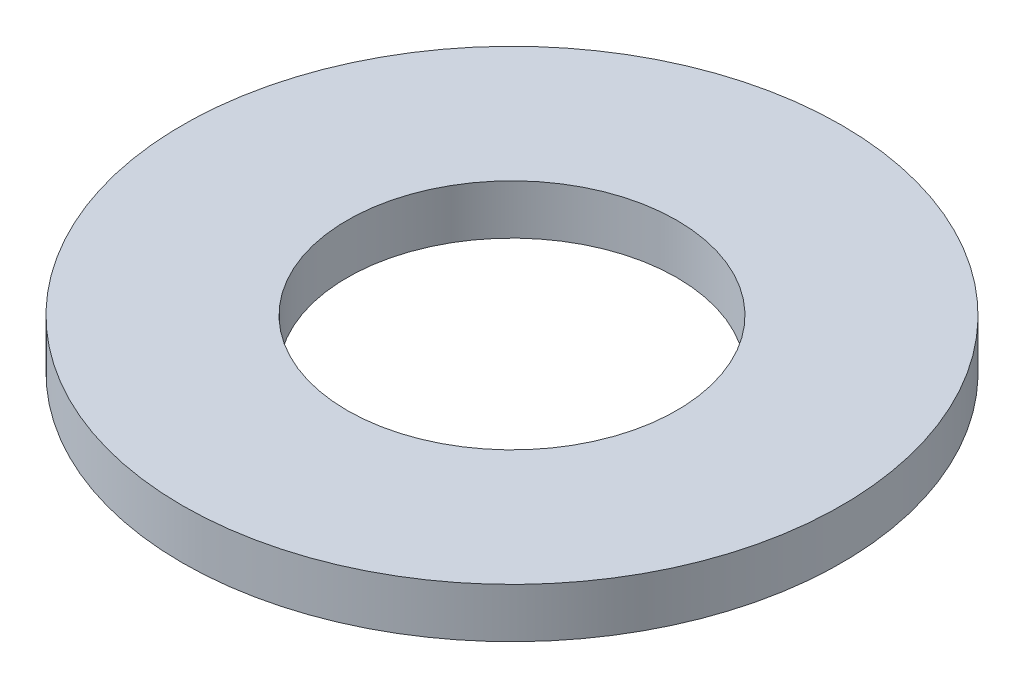
ISO-10303-21;
HEADER;
FILE_DESCRIPTION(('STEP AP214'),'2;1');
FILE_NAME('part.step','',(''),(''),'','','');
FILE_SCHEMA(('AUTOMOTIVE_DESIGN { 1 0 10303 214 1 1 1 1 }'));
ENDSEC;
DATA;
#1=APPLICATION_CONTEXT('core data for automotive mechanical design processes');
#2=APPLICATION_PROTOCOL_DEFINITION('international standard','automotive_design',2000,#1);
#3=PRODUCT_CONTEXT('',#1,'mechanical');
#4=PRODUCT('Part','Part','',(#3));
#5=PRODUCT_RELATED_PRODUCT_CATEGORY('part','',(#4));
#6=PRODUCT_DEFINITION_FORMATION('','',#4);
#7=PRODUCT_DEFINITION_CONTEXT('part definition',#1,'design');
#8=PRODUCT_DEFINITION('design','',#6,#7);
#9=PRODUCT_DEFINITION_SHAPE('','',#8);
#10=(LENGTH_UNIT() NAMED_UNIT(*) SI_UNIT(.MILLI.,.METRE.));
#11=(NAMED_UNIT(*) PLANE_ANGLE_UNIT() SI_UNIT($,.RADIAN.));
#12=(NAMED_UNIT(*) SI_UNIT($,.STERADIAN.) SOLID_ANGLE_UNIT());
#13=UNCERTAINTY_MEASURE_WITH_UNIT(LENGTH_MEASURE(1.E-05),#10,'distance_accuracy_value','');
#14=(GEOMETRIC_REPRESENTATION_CONTEXT(3) GLOBAL_UNCERTAINTY_ASSIGNED_CONTEXT((#13)) GLOBAL_UNIT_ASSIGNED_CONTEXT((#10,
#11,#12)) REPRESENTATION_CONTEXT('',''));
#15=CARTESIAN_POINT('',(0.,0.,0.));
#16=DIRECTION('',(0.,0.,1.));
#17=DIRECTION('',(1.,0.,0.));
#18=AXIS2_PLACEMENT_3D('',#15,#16,#17);
#19=CARTESIAN_POINT('',(0.,2.032,0.));
#20=DIRECTION('',(0.,-1.,0.));
#21=DIRECTION('',(0.,0.,-1.));
#22=AXIS2_PLACEMENT_3D('',#19,#20,#21);
#23=CYLINDRICAL_SURFACE('',#22,13.49375);
#24=CARTESIAN_POINT('',(0.,2.032,0.));
#25=DIRECTION('',(0.,1.,0.));
#26=DIRECTION('',(0.,0.,1.));
#27=AXIS2_PLACEMENT_3D('',#24,#25,#26);
#28=CIRCLE('',#27,13.49375);
#29=CARTESIAN_POINT('',(0.,2.032,13.49375));
#30=VERTEX_POINT('',#29);
#31=EDGE_CURVE('E10',#30,#30,#28,.T.);
#32=ORIENTED_EDGE('',*,*,#31,.F.);
#33=EDGE_LOOP('',(#32));
#34=FACE_BOUND('',#33,.T.);
#35=CARTESIAN_POINT('',(0.,0.,0.));
#36=DIRECTION('',(0.,1.,0.));
#37=DIRECTION('',(0.,0.,1.));
#38=AXIS2_PLACEMENT_3D('',#35,#36,#37);
#39=CIRCLE('',#38,13.49375);
#40=CARTESIAN_POINT('',(0.,0.,13.49375));
#41=VERTEX_POINT('',#40);
#42=EDGE_CURVE('E37',#41,#41,#39,.T.);
#43=ORIENTED_EDGE('',*,*,#42,.T.);
#44=EDGE_LOOP('',(#43));
#45=FACE_BOUND('',#44,.T.);
#46=ADVANCED_FACE('F34',(#34,#45),#23,.T.);
#47=CARTESIAN_POINT('',(0.,2.032,0.));
#48=DIRECTION('',(0.,1.,0.));
#49=DIRECTION('',(0.,0.,1.));
#50=AXIS2_PLACEMENT_3D('',#47,#48,#49);
#51=PLANE('',#50);
#52=CARTESIAN_POINT('',(0.,2.032,0.));
#53=DIRECTION('',(0.,1.,0.));
#54=DIRECTION('',(0.,0.,1.));
#55=AXIS2_PLACEMENT_3D('',#52,#53,#54);
#56=CIRCLE('',#55,6.746875);
#57=CARTESIAN_POINT('',(0.,2.032,6.746875));
#58=VERTEX_POINT('',#57);
#59=EDGE_CURVE('E46',#58,#58,#56,.T.);
#60=ORIENTED_EDGE('',*,*,#59,.F.);
#61=EDGE_LOOP('',(#60));
#62=FACE_BOUND('',#61,.T.);
#63=ORIENTED_EDGE('',*,*,#31,.T.);
#64=EDGE_LOOP('',(#63));
#65=FACE_BOUND('',#64,.T.);
#66=ADVANCED_FACE('F61',(#62,#65),#51,.T.);
#67=CARTESIAN_POINT('',(0.,0.,0.));
#68=DIRECTION('',(0.,1.,0.));
#69=DIRECTION('',(0.,0.,1.));
#70=AXIS2_PLACEMENT_3D('',#67,#68,#69);
#71=PLANE('',#70);
#72=CARTESIAN_POINT('',(0.,0.,0.));
#73=DIRECTION('',(0.,1.,0.));
#74=DIRECTION('',(0.,0.,1.));
#75=AXIS2_PLACEMENT_3D('',#72,#73,#74);
#76=CIRCLE('',#75,6.746875);
#77=CARTESIAN_POINT('',(0.,0.,6.746875));
#78=VERTEX_POINT('',#77);
#79=EDGE_CURVE('E44',#78,#78,#76,.T.);
#80=ORIENTED_EDGE('',*,*,#79,.T.);
#81=EDGE_LOOP('',(#80));
#82=FACE_BOUND('',#81,.T.);
#83=ORIENTED_EDGE('',*,*,#42,.F.);
#84=EDGE_LOOP('',(#83));
#85=FACE_BOUND('',#84,.T.);
#86=ADVANCED_FACE('F52',(#82,#85),#71,.F.);
#87=CARTESIAN_POINT('',(0.,0.,0.));
#88=DIRECTION('',(0.,1.,0.));
#89=DIRECTION('',(0.,0.,1.));
#90=AXIS2_PLACEMENT_3D('',#87,#88,#89);
#91=CYLINDRICAL_SURFACE('',#90,6.746875);
#92=ORIENTED_EDGE('',*,*,#79,.F.);
#93=EDGE_LOOP('',(#92));
#94=FACE_BOUND('',#93,.T.);
#95=ORIENTED_EDGE('',*,*,#59,.T.);
#96=EDGE_LOOP('',(#95));
#97=FACE_BOUND('',#96,.T.);
#98=ADVANCED_FACE('F55',(#94,#97),#91,.F.);
#99=CLOSED_SHELL('',(#46,#66,#86,#98));
#100=MANIFOLD_SOLID_BREP('B2',#99);
#101=ADVANCED_BREP_SHAPE_REPRESENTATION('',(#18,#100),#14);
#102=SHAPE_DEFINITION_REPRESENTATION(#9,#101);
ENDSEC;
END-ISO-10303-21;
